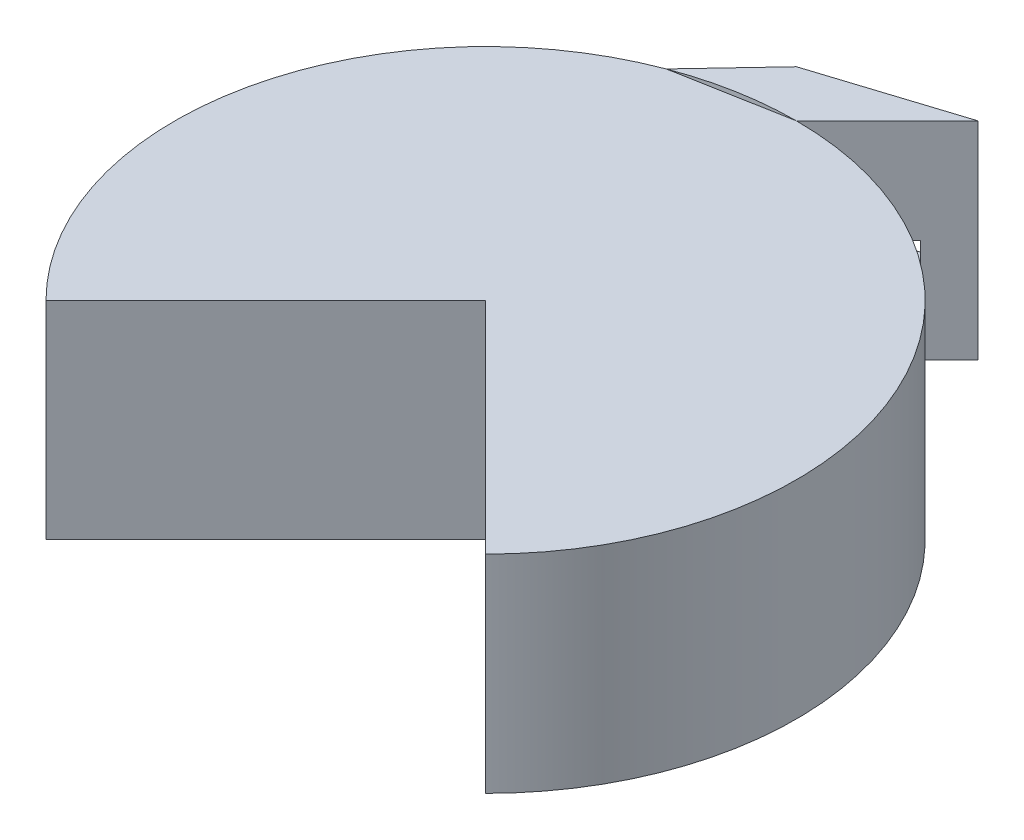
ISO-10303-21;
HEADER;
FILE_DESCRIPTION(('STEP AP214'),'2;1');
FILE_NAME('part.step','',(''),(''),'','','');
FILE_SCHEMA(('AUTOMOTIVE_DESIGN { 1 0 10303 214 1 1 1 1 }'));
ENDSEC;
DATA;
#1=APPLICATION_CONTEXT('core data for automotive mechanical design processes');
#2=APPLICATION_PROTOCOL_DEFINITION('international standard','automotive_design',2000,#1);
#3=PRODUCT_CONTEXT('',#1,'mechanical');
#4=PRODUCT('Part','Part','',(#3));
#5=PRODUCT_RELATED_PRODUCT_CATEGORY('part','',(#4));
#6=PRODUCT_DEFINITION_FORMATION('','',#4);
#7=PRODUCT_DEFINITION_CONTEXT('part definition',#1,'design');
#8=PRODUCT_DEFINITION('design','',#6,#7);
#9=PRODUCT_DEFINITION_SHAPE('','',#8);
#10=(LENGTH_UNIT() NAMED_UNIT(*) SI_UNIT(.MILLI.,.METRE.));
#11=(NAMED_UNIT(*) PLANE_ANGLE_UNIT() SI_UNIT($,.RADIAN.));
#12=(NAMED_UNIT(*) SI_UNIT($,.STERADIAN.) SOLID_ANGLE_UNIT());
#13=UNCERTAINTY_MEASURE_WITH_UNIT(LENGTH_MEASURE(1.E-05),#10,'distance_accuracy_value','');
#14=(GEOMETRIC_REPRESENTATION_CONTEXT(3) GLOBAL_UNCERTAINTY_ASSIGNED_CONTEXT((#13)) GLOBAL_UNIT_ASSIGNED_CONTEXT((#10,
#11,#12)) REPRESENTATION_CONTEXT('',''));
#15=CARTESIAN_POINT('',(0.,0.,0.));
#16=DIRECTION('',(0.,0.,1.));
#17=DIRECTION('',(1.,0.,0.));
#18=AXIS2_PLACEMENT_3D('',#15,#16,#17);
#19=CARTESIAN_POINT('',(-26.0271420220497,50.,-81.6219740955962));
#20=DIRECTION('',(0.303802613424122,0.,0.952734995723718));
#21=DIRECTION('',(0.952734995723718,0.,-0.303802613424122));
#22=AXIS2_PLACEMENT_3D('',#19,#20,#21);
#23=PLANE('',#22);
#24=DIRECTION('',(-0.952734995723718,0.,0.303802613424122));
#25=VECTOR('',#24,1.);
#26=CARTESIAN_POINT('',(-26.0271420220497,0.,-81.6219740955962));
#27=LINE('',#26,#25);
#28=CARTESIAN_POINT('',(21.9069052734475,0.,-96.9069052734475));
#29=VERTEX_POINT('',#28);
#30=CARTESIAN_POINT('',(-11.3137084989848,0.,-86.3137084989847));
#31=VERTEX_POINT('',#30);
#32=EDGE_CURVE('E199',#29,#31,#27,.T.);
#33=ORIENTED_EDGE('',*,*,#32,.T.);
#34=DIRECTION('',(0.,-1.,0.));
#35=VECTOR('',#34,1.);
#36=CARTESIAN_POINT('',(-11.3137084989848,50.,-86.3137084989847));
#37=LINE('',#36,#35);
#38=CARTESIAN_POINT('',(-11.3137084989848,50.,-86.3137084989847));
#39=VERTEX_POINT('',#38);
#40=EDGE_CURVE('E204',#39,#31,#37,.T.);
#41=ORIENTED_EDGE('',*,*,#40,.F.);
#42=DIRECTION('',(-0.952734995723718,0.,0.303802613424122));
#43=VECTOR('',#42,1.);
#44=CARTESIAN_POINT('',(-26.0271420220497,50.,-81.6219740955962));
#45=LINE('',#44,#43);
#46=CARTESIAN_POINT('',(21.9069052734475,50.,-96.9069052734475));
#47=VERTEX_POINT('',#46);
#48=EDGE_CURVE('E190',#47,#39,#45,.T.);
#49=ORIENTED_EDGE('',*,*,#48,.F.);
#50=DIRECTION('',(0.,-1.,0.));
#51=VECTOR('',#50,1.);
#52=CARTESIAN_POINT('',(21.9069052734475,50.,-96.9069052734475));
#53=LINE('',#52,#51);
#54=EDGE_CURVE('E206',#47,#29,#53,.T.);
#55=ORIENTED_EDGE('',*,*,#54,.T.);
#56=EDGE_LOOP('',(#33,#41,#49,#55));
#57=FACE_BOUND('',#56,.T.);
#58=DIRECTION('',(0.,-1.,0.));
#59=VECTOR('',#58,1.);
#60=CARTESIAN_POINT('',(-5.45294808413494,0.,-88.1825538113495));
#61=LINE('',#60,#59);
#62=CARTESIAN_POINT('',(-5.45294808413493,25.,-88.1825538113494));
#63=VERTEX_POINT('',#62);
#64=CARTESIAN_POINT('',(-5.45294808413494,19.,-88.1825538113495));
#65=VERTEX_POINT('',#64);
#66=EDGE_CURVE('E95',#63,#65,#61,.T.);
#67=ORIENTED_EDGE('',*,*,#66,.T.);
#68=DIRECTION('',(-0.952734995723718,0.,0.303802613424122));
#69=VECTOR('',#68,1.);
#70=CARTESIAN_POINT('',(-26.0271420220497,19.,-81.6219740955963));
#71=LINE('',#70,#69);
#72=CARTESIAN_POINT('',(13.6017518303394,19.,-94.2586060798319));
#73=VERTEX_POINT('',#72);
#74=EDGE_CURVE('E160',#73,#65,#71,.T.);
#75=ORIENTED_EDGE('',*,*,#74,.F.);
#76=DIRECTION('',(0.,-1.,0.));
#77=VECTOR('',#76,1.);
#78=CARTESIAN_POINT('',(13.6017518303395,0.,-94.2586060798319));
#79=LINE('',#78,#77);
#80=CARTESIAN_POINT('',(13.6017518303394,25.,-94.2586060798319));
#81=VERTEX_POINT('',#80);
#82=EDGE_CURVE('E146',#81,#73,#79,.T.);
#83=ORIENTED_EDGE('',*,*,#82,.F.);
#84=DIRECTION('',(-0.952734995723718,0.,0.303802613424122));
#85=VECTOR('',#84,1.);
#86=CARTESIAN_POINT('',(-26.0271420220497,25.,-81.6219740955963));
#87=LINE('',#86,#85);
#88=EDGE_CURVE('E155',#81,#63,#87,.T.);
#89=ORIENTED_EDGE('',*,*,#88,.T.);
#90=EDGE_LOOP('',(#67,#75,#83,#89));
#91=FACE_BOUND('',#90,.T.);
#92=ADVANCED_FACE('F72',(#57,#91),#23,.F.);
#93=CARTESIAN_POINT('',(0.,50.,0.));
#94=DIRECTION('',(0.,-1.,0.));
#95=DIRECTION('',(0.,0.,-1.));
#96=AXIS2_PLACEMENT_3D('',#93,#94,#95);
#97=CYLINDRICAL_SURFACE('',#96,75.);
#98=CARTESIAN_POINT('',(0.,19.,0.));
#99=DIRECTION('',(0.,-1.,0.));
#100=DIRECTION('',(0.,0.,-1.));
#101=AXIS2_PLACEMENT_3D('',#98,#99,#100);
#102=CIRCLE('',#101,75.);
#103=CARTESIAN_POINT('',(-1.24607074567603,19.,-74.9896480035529));
#104=VERTEX_POINT('',#103);
#105=CARTESIAN_POINT('',(0.,19.,-75.));
#106=VERTEX_POINT('',#105);
#107=EDGE_CURVE('E178',#104,#106,#102,.T.);
#108=ORIENTED_EDGE('',*,*,#107,.F.);
#109=DIRECTION('',(0.,-1.,0.));
#110=VECTOR('',#109,1.);
#111=CARTESIAN_POINT('',(-1.24607074567604,50.,-74.9896480035529));
#112=LINE('',#111,#110);
#113=CARTESIAN_POINT('',(-1.24607074567603,25.,-74.9896480035529));
#114=VERTEX_POINT('',#113);
#115=EDGE_CURVE('E180',#104,#114,#112,.F.);
#116=ORIENTED_EDGE('',*,*,#115,.T.);
#117=CARTESIAN_POINT('',(0.,25.,0.));
#118=DIRECTION('',(0.,-1.,0.));
#119=DIRECTION('',(0.,0.,-1.));
#120=AXIS2_PLACEMENT_3D('',#117,#118,#119);
#121=CIRCLE('',#120,75.);
#122=CARTESIAN_POINT('',(0.,25.,-75.));
#123=VERTEX_POINT('',#122);
#124=EDGE_CURVE('E171',#114,#123,#121,.T.);
#125=ORIENTED_EDGE('',*,*,#124,.T.);
#126=DIRECTION('',(0.,-1.,0.));
#127=VECTOR('',#126,1.);
#128=CARTESIAN_POINT('',(0.,50.,-75.));
#129=LINE('',#128,#127);
#130=CARTESIAN_POINT('',(0.,50.,-75.));
#131=VERTEX_POINT('',#130);
#132=EDGE_CURVE('E13',#131,#123,#129,.T.);
#133=ORIENTED_EDGE('',*,*,#132,.F.);
#134=CARTESIAN_POINT('',(0.,50.,0.));
#135=DIRECTION('',(0.,1.,0.));
#136=DIRECTION('',(0.,0.,1.));
#137=AXIS2_PLACEMENT_3D('',#134,#135,#136);
#138=CIRCLE('',#137,75.);
#139=CARTESIAN_POINT('',(-26.5554550147983,50.,-70.1413416535286));
#140=VERTEX_POINT('',#139);
#141=EDGE_CURVE('E184',#131,#140,#138,.T.);
#142=ORIENTED_EDGE('',*,*,#141,.T.);
#143=DIRECTION('',(0.,-1.,0.));
#144=VECTOR('',#143,1.);
#145=CARTESIAN_POINT('',(-26.5554550147983,50.,-70.1413416535286));
#146=LINE('',#145,#144);
#147=CARTESIAN_POINT('',(-26.5554550147983,0.,-70.1413416535286));
#148=VERTEX_POINT('',#147);
#149=EDGE_CURVE('E194',#140,#148,#146,.T.);
#150=ORIENTED_EDGE('',*,*,#149,.T.);
#151=CARTESIAN_POINT('',(0.,0.,0.));
#152=DIRECTION('',(0.,1.,0.));
#153=DIRECTION('',(0.,0.,1.));
#154=AXIS2_PLACEMENT_3D('',#151,#152,#153);
#155=CIRCLE('',#154,75.);
#156=CARTESIAN_POINT('',(0.,0.,-75.));
#157=VERTEX_POINT('',#156);
#158=EDGE_CURVE('E183',#157,#148,#155,.T.);
#159=ORIENTED_EDGE('',*,*,#158,.F.);
#160=EDGE_CURVE('E80',#106,#157,#129,.T.);
#161=ORIENTED_EDGE('',*,*,#160,.F.);
#162=EDGE_LOOP('',(#108,#116,#125,#133,#142,#150,#159,#161));
#163=FACE_BOUND('',#162,.T.);
#164=ADVANCED_FACE('F74',(#163),#97,.F.);
#165=CARTESIAN_POINT('',(-37.5,50.,-37.4999999999999));
#166=DIRECTION('',(-0.707106781186548,0.,-0.707106781186547));
#167=DIRECTION('',(-0.707106781186547,0.,0.707106781186548));
#168=AXIS2_PLACEMENT_3D('',#165,#166,#167);
#169=PLANE('',#168);
#170=DIRECTION('',(0.,-1.,0.));
#171=VECTOR('',#170,1.);
#172=CARTESIAN_POINT('',(14.9694523211513,50.0000000000002,-89.9694523211513));
#173=LINE('',#172,#171);
#174=CARTESIAN_POINT('',(14.9694523211514,25.,-89.9694523211514));
#175=VERTEX_POINT('',#174);
#176=CARTESIAN_POINT('',(14.9694523211514,19.,-89.9694523211514));
#177=VERTEX_POINT('',#176);
#178=EDGE_CURVE('E149',#175,#177,#173,.T.);
#179=ORIENTED_EDGE('',*,*,#178,.T.);
#180=DIRECTION('',(-0.707106781186547,0.,0.707106781186548));
#181=VECTOR('',#180,1.);
#182=CARTESIAN_POINT('',(-37.5,19.,-37.4999999999999));
#183=LINE('',#182,#181);
#184=EDGE_CURVE('E175',#177,#106,#183,.T.);
#185=ORIENTED_EDGE('',*,*,#184,.T.);
#186=ORIENTED_EDGE('',*,*,#160,.T.);
#187=DIRECTION('',(0.707106781186547,0.,-0.707106781186548));
#188=VECTOR('',#187,1.);
#189=CARTESIAN_POINT('',(-37.5,0.,-37.4999999999999));
#190=LINE('',#189,#188);
#191=EDGE_CURVE('E197',#157,#29,#190,.T.);
#192=ORIENTED_EDGE('',*,*,#191,.T.);
#193=ORIENTED_EDGE('',*,*,#54,.F.);
#194=DIRECTION('',(0.707106781186547,0.,-0.707106781186548));
#195=VECTOR('',#194,1.);
#196=CARTESIAN_POINT('',(-37.5,50.,-37.4999999999999));
#197=LINE('',#196,#195);
#198=EDGE_CURVE('E187',#131,#47,#197,.T.);
#199=ORIENTED_EDGE('',*,*,#198,.F.);
#200=ORIENTED_EDGE('',*,*,#132,.T.);
#201=DIRECTION('',(-0.707106781186547,0.,0.707106781186548));
#202=VECTOR('',#201,1.);
#203=CARTESIAN_POINT('',(-37.5,25.,-37.4999999999999));
#204=LINE('',#203,#202);
#205=EDGE_CURVE('E167',#175,#123,#204,.T.);
#206=ORIENTED_EDGE('',*,*,#205,.F.);
#207=EDGE_LOOP('',(#179,#185,#186,#192,#193,#199,#200,#206));
#208=FACE_BOUND('',#207,.T.);
#209=ADVANCED_FACE('F215',(#208),#169,.F.);
#210=CARTESIAN_POINT('',(-49.0728927412566,50.,-46.2490493263877));
#211=DIRECTION('',(0.727735047590559,0.,0.685858367673944));
#212=DIRECTION('',(0.685858367673944,0.,-0.727735047590559));
#213=AXIS2_PLACEMENT_3D('',#210,#211,#212);
#214=PLANE('',#213);
#215=DIRECTION('',(-0.685858367673944,0.,0.727735047590559));
#216=VECTOR('',#215,1.);
#217=CARTESIAN_POINT('',(-49.0728927412566,0.,-46.2490493263877));
#218=LINE('',#217,#216);
#219=EDGE_CURVE('E188',#31,#148,#218,.T.);
#220=ORIENTED_EDGE('',*,*,#219,.T.);
#221=ORIENTED_EDGE('',*,*,#149,.F.);
#222=DIRECTION('',(-0.685858367673944,0.,0.727735047590559));
#223=VECTOR('',#222,1.);
#224=CARTESIAN_POINT('',(-49.0728927412566,50.,-46.2490493263877));
#225=LINE('',#224,#223);
#226=EDGE_CURVE('E192',#39,#140,#225,.T.);
#227=ORIENTED_EDGE('',*,*,#226,.F.);
#228=ORIENTED_EDGE('',*,*,#40,.T.);
#229=EDGE_LOOP('',(#220,#221,#227,#228));
#230=FACE_BOUND('',#229,.T.);
#231=ADVANCED_FACE('F226',(#230),#214,.F.);
#232=CARTESIAN_POINT('',(0.,50.,0.));
#233=DIRECTION('',(0.,1.,0.));
#234=DIRECTION('',(0.,0.,1.));
#235=AXIS2_PLACEMENT_3D('',#232,#233,#234);
#236=PLANE('',#235);
#237=ORIENTED_EDGE('',*,*,#141,.F.);
#238=ORIENTED_EDGE('',*,*,#198,.T.);
#239=ORIENTED_EDGE('',*,*,#48,.T.);
#240=ORIENTED_EDGE('',*,*,#226,.T.);
#241=EDGE_LOOP('',(#237,#238,#239,#240));
#242=FACE_BOUND('',#241,.T.);
#243=ADVANCED_FACE('F229',(#242),#236,.T.);
#244=CARTESIAN_POINT('',(0.,0.,0.));
#245=DIRECTION('',(0.,1.,0.));
#246=DIRECTION('',(0.,0.,1.));
#247=AXIS2_PLACEMENT_3D('',#244,#245,#246);
#248=PLANE('',#247);
#249=ORIENTED_EDGE('',*,*,#158,.T.);
#250=ORIENTED_EDGE('',*,*,#219,.F.);
#251=ORIENTED_EDGE('',*,*,#32,.F.);
#252=ORIENTED_EDGE('',*,*,#191,.F.);
#253=EDGE_LOOP('',(#249,#250,#251,#252));
#254=FACE_BOUND('',#253,.T.);
#255=ADVANCED_FACE('F220',(#254),#248,.F.);
#256=CARTESIAN_POINT('',(18.4625936451254,0.,-79.0148461482524));
#257=DIRECTION('',(0.952734995723718,0.,-0.303802613424122));
#258=DIRECTION('',(-0.303802613424122,0.,-0.952734995723718));
#259=AXIS2_PLACEMENT_3D('',#256,#257,#258);
#260=PLANE('',#259);
#261=DIRECTION('',(-0.303802613424122,0.,-0.952734995723718));
#262=VECTOR('',#261,1.);
#263=CARTESIAN_POINT('',(18.4625936451254,25.,-79.0148461482524));
#264=LINE('',#263,#262);
#265=EDGE_CURVE('E87',#175,#81,#264,.T.);
#266=ORIENTED_EDGE('',*,*,#265,.T.);
#267=ORIENTED_EDGE('',*,*,#82,.T.);
#268=DIRECTION('',(-0.303802613424122,0.,-0.952734995723718));
#269=VECTOR('',#268,1.);
#270=CARTESIAN_POINT('',(18.4625936451254,19.,-79.0148461482524));
#271=LINE('',#270,#269);
#272=EDGE_CURVE('E151',#177,#73,#271,.T.);
#273=ORIENTED_EDGE('',*,*,#272,.F.);
#274=ORIENTED_EDGE('',*,*,#178,.F.);
#275=EDGE_LOOP('',(#266,#267,#273,#274));
#276=FACE_BOUND('',#275,.T.);
#277=ADVANCED_FACE('F143',(#276),#260,.F.);
#278=CARTESIAN_POINT('',(-0.592106269348992,0.,-72.93879387977));
#279=DIRECTION('',(0.952734995723718,0.,-0.303802613424122));
#280=DIRECTION('',(-0.303802613424122,0.,-0.952734995723718));
#281=AXIS2_PLACEMENT_3D('',#278,#279,#280);
#282=PLANE('',#281);
#283=DIRECTION('',(-0.303802613424122,0.,-0.952734995723718));
#284=VECTOR('',#283,1.);
#285=CARTESIAN_POINT('',(-0.59210626934899,19.,-72.93879387977));
#286=LINE('',#285,#284);
#287=EDGE_CURVE('E165',#104,#65,#286,.T.);
#288=ORIENTED_EDGE('',*,*,#287,.T.);
#289=ORIENTED_EDGE('',*,*,#66,.F.);
#290=DIRECTION('',(-0.303802613424122,0.,-0.952734995723718));
#291=VECTOR('',#290,1.);
#292=CARTESIAN_POINT('',(-0.592106269348985,25.,-72.93879387977));
#293=LINE('',#292,#291);
#294=EDGE_CURVE('E152',#114,#63,#293,.T.);
#295=ORIENTED_EDGE('',*,*,#294,.F.);
#296=ORIENTED_EDGE('',*,*,#115,.F.);
#297=EDGE_LOOP('',(#288,#289,#295,#296));
#298=FACE_BOUND('',#297,.T.);
#299=ADVANCED_FACE('F231',(#298),#282,.T.);
#300=CARTESIAN_POINT('',(-21.1663002072637,19.,-66.3782141640168));
#301=DIRECTION('',(0.,-1.,0.));
#302=DIRECTION('',(0.,0.,-1.));
#303=AXIS2_PLACEMENT_3D('',#300,#301,#302);
#304=PLANE('',#303);
#305=ORIENTED_EDGE('',*,*,#107,.T.);
#306=ORIENTED_EDGE('',*,*,#184,.F.);
#307=ORIENTED_EDGE('',*,*,#272,.T.);
#308=ORIENTED_EDGE('',*,*,#74,.T.);
#309=ORIENTED_EDGE('',*,*,#287,.F.);
#310=EDGE_LOOP('',(#305,#306,#307,#308,#309));
#311=FACE_BOUND('',#310,.T.);
#312=ADVANCED_FACE('F234',(#311),#304,.F.);
#313=CARTESIAN_POINT('',(-21.1663002072637,25.,-66.3782141640168));
#314=DIRECTION('',(0.,-1.,0.));
#315=DIRECTION('',(0.,0.,-1.));
#316=AXIS2_PLACEMENT_3D('',#313,#314,#315);
#317=PLANE('',#316);
#318=ORIENTED_EDGE('',*,*,#294,.T.);
#319=ORIENTED_EDGE('',*,*,#88,.F.);
#320=ORIENTED_EDGE('',*,*,#265,.F.);
#321=ORIENTED_EDGE('',*,*,#205,.T.);
#322=ORIENTED_EDGE('',*,*,#124,.F.);
#323=EDGE_LOOP('',(#318,#319,#320,#321,#322));
#324=FACE_BOUND('',#323,.T.);
#325=ADVANCED_FACE('F156',(#324),#317,.T.);
#326=CLOSED_SHELL('',(#92,#164,#209,#231,#243,#255,#277,#299,#312,#325));
#327=MANIFOLD_SOLID_BREP('B2',#326);
#328=CARTESIAN_POINT('',(0.,50.,0.));
#329=DIRECTION('',(-0.707106781186548,0.,0.707106781186548));
#330=DIRECTION('',(0.707106781186548,0.,0.707106781186548));
#331=AXIS2_PLACEMENT_3D('',#328,#329,#330);
#332=PLANE('',#331);
#333=DIRECTION('',(-0.707106781186548,0.,-0.707106781186548));
#334=VECTOR('',#333,1.);
#335=CARTESIAN_POINT('',(0.,0.,0.));
#336=LINE('',#335,#334);
#337=CARTESIAN_POINT('',(53.0330085889911,0.,53.0330085889911));
#338=VERTEX_POINT('',#337);
#339=CARTESIAN_POINT('',(0.,0.,0.));
#340=VERTEX_POINT('',#339);
#341=EDGE_CURVE('E420',#338,#340,#336,.T.);
#342=ORIENTED_EDGE('',*,*,#341,.F.);
#343=DIRECTION('',(0.,-1.,0.));
#344=VECTOR('',#343,1.);
#345=CARTESIAN_POINT('',(53.0330085889911,50.,53.0330085889911));
#346=LINE('',#345,#344);
#347=CARTESIAN_POINT('',(53.0330085889911,50.,53.0330085889911));
#348=VERTEX_POINT('',#347);
#349=EDGE_CURVE('E378',#348,#338,#346,.T.);
#350=ORIENTED_EDGE('',*,*,#349,.F.);
#351=DIRECTION('',(-0.707106781186548,0.,-0.707106781186548));
#352=VECTOR('',#351,1.);
#353=CARTESIAN_POINT('',(0.,50.,0.));
#354=LINE('',#353,#352);
#355=CARTESIAN_POINT('',(0.,50.,0.));
#356=VERTEX_POINT('',#355);
#357=EDGE_CURVE('E415',#348,#356,#354,.T.);
#358=ORIENTED_EDGE('',*,*,#357,.T.);
#359=DIRECTION('',(0.,-1.,0.));
#360=VECTOR('',#359,1.);
#361=CARTESIAN_POINT('',(0.,50.,0.));
#362=LINE('',#361,#360);
#363=EDGE_CURVE('E351',#356,#340,#362,.T.);
#364=ORIENTED_EDGE('',*,*,#363,.T.);
#365=EDGE_LOOP('',(#342,#350,#358,#364));
#366=FACE_BOUND('',#365,.T.);
#367=ADVANCED_FACE('F328',(#366),#332,.T.);
#368=CARTESIAN_POINT('',(0.,50.,0.));
#369=DIRECTION('',(0.,-1.,0.));
#370=DIRECTION('',(0.,0.,-1.));
#371=AXIS2_PLACEMENT_3D('',#368,#369,#370);
#372=CYLINDRICAL_SURFACE('',#371,75.);
#373=DIRECTION('',(0.,-1.,0.));
#374=VECTOR('',#373,1.);
#375=CARTESIAN_POINT('',(0.,50.,-75.));
#376=LINE('',#375,#374);
#377=CARTESIAN_POINT('',(0.,19.,-75.));
#378=VERTEX_POINT('',#377);
#379=CARTESIAN_POINT('',(0.,0.,-75.));
#380=VERTEX_POINT('',#379);
#381=EDGE_CURVE('E400',#378,#380,#376,.T.);
#382=ORIENTED_EDGE('',*,*,#381,.F.);
#383=CARTESIAN_POINT('',(0.,19.,0.));
#384=DIRECTION('',(0.,-1.,0.));
#385=DIRECTION('',(0.,0.,-1.));
#386=AXIS2_PLACEMENT_3D('',#383,#384,#385);
#387=CIRCLE('',#386,75.);
#388=CARTESIAN_POINT('',(5.28681921799899,19.,-74.8134315651688));
#389=VERTEX_POINT('',#388);
#390=EDGE_CURVE('E423',#378,#389,#387,.T.);
#391=ORIENTED_EDGE('',*,*,#390,.T.);
#392=DIRECTION('',(0.,-1.,0.));
#393=VECTOR('',#392,1.);
#394=CARTESIAN_POINT('',(5.28681921799899,50.,-74.8134315651688));
#395=LINE('',#394,#393);
#396=CARTESIAN_POINT('',(5.28681921799899,25.,-74.8134315651688));
#397=VERTEX_POINT('',#396);
#398=EDGE_CURVE('E70',#397,#389,#395,.T.);
#399=ORIENTED_EDGE('',*,*,#398,.F.);
#400=CARTESIAN_POINT('',(0.,25.,0.));
#401=DIRECTION('',(0.,-1.,0.));
#402=DIRECTION('',(0.,0.,-1.));
#403=AXIS2_PLACEMENT_3D('',#400,#401,#402);
#404=CIRCLE('',#403,75.);
#405=CARTESIAN_POINT('',(0.,25.,-75.));
#406=VERTEX_POINT('',#405);
#407=EDGE_CURVE('E460',#406,#397,#404,.T.);
#408=ORIENTED_EDGE('',*,*,#407,.F.);
#409=CARTESIAN_POINT('',(0.,50.,-75.));
#410=VERTEX_POINT('',#409);
#411=EDGE_CURVE('E434',#410,#406,#376,.T.);
#412=ORIENTED_EDGE('',*,*,#411,.F.);
#413=CARTESIAN_POINT('',(0.,50.,0.));
#414=DIRECTION('',(0.,1.,0.));
#415=DIRECTION('',(0.,0.,1.));
#416=AXIS2_PLACEMENT_3D('',#413,#414,#415);
#417=CIRCLE('',#416,75.);
#418=EDGE_CURVE('E412',#348,#410,#417,.T.);
#419=ORIENTED_EDGE('',*,*,#418,.F.);
#420=ORIENTED_EDGE('',*,*,#349,.T.);
#421=CARTESIAN_POINT('',(0.,0.,0.));
#422=DIRECTION('',(0.,1.,0.));
#423=DIRECTION('',(0.,0.,1.));
#424=AXIS2_PLACEMENT_3D('',#421,#422,#423);
#425=CIRCLE('',#424,75.);
#426=EDGE_CURVE('E422',#338,#380,#425,.T.);
#427=ORIENTED_EDGE('',*,*,#426,.T.);
#428=EDGE_LOOP('',(#382,#391,#399,#408,#412,#419,#420,#427));
#429=FACE_BOUND('',#428,.T.);
#430=ADVANCED_FACE('F471',(#429),#372,.T.);
#431=CARTESIAN_POINT('',(-13.2777275073992,50.,-72.5706708267643));
#432=DIRECTION('',(-0.179975152849339,0.,-0.983671156615287));
#433=DIRECTION('',(-0.983671156615287,0.,0.179975152849339));
#434=AXIS2_PLACEMENT_3D('',#431,#432,#433);
#435=PLANE('',#434);
#436=DIRECTION('',(-0.983671156615287,0.,0.179975152849339));
#437=VECTOR('',#436,1.);
#438=CARTESIAN_POINT('',(-13.2777275073992,19.,-72.5706708267643));
#439=LINE('',#438,#437);
#440=CARTESIAN_POINT('',(-1.18049895128723,19.,-74.7840126979758));
#441=VERTEX_POINT('',#440);
#442=EDGE_CURVE('E335',#378,#441,#439,.T.);
#443=ORIENTED_EDGE('',*,*,#442,.F.);
#444=ORIENTED_EDGE('',*,*,#381,.T.);
#445=DIRECTION('',(0.983671156615287,0.,-0.179975152849339));
#446=VECTOR('',#445,1.);
#447=CARTESIAN_POINT('',(-13.2777275073992,0.,-72.5706708267643));
#448=LINE('',#447,#446);
#449=CARTESIAN_POINT('',(-26.5554550147983,0.,-70.1413416535286));
#450=VERTEX_POINT('',#449);
#451=EDGE_CURVE('E396',#450,#380,#448,.T.);
#452=ORIENTED_EDGE('',*,*,#451,.F.);
#453=DIRECTION('',(0.,-1.,0.));
#454=VECTOR('',#453,1.);
#455=CARTESIAN_POINT('',(-26.5554550147983,50.,-70.1413416535286));
#456=LINE('',#455,#454);
#457=CARTESIAN_POINT('',(-26.5554550147983,50.,-70.1413416535286));
#458=VERTEX_POINT('',#457);
#459=EDGE_CURVE('E388',#458,#450,#456,.T.);
#460=ORIENTED_EDGE('',*,*,#459,.F.);
#461=DIRECTION('',(0.983671156615287,0.,-0.179975152849339));
#462=VECTOR('',#461,1.);
#463=CARTESIAN_POINT('',(-13.2777275073992,50.,-72.5706708267643));
#464=LINE('',#463,#462);
#465=EDGE_CURVE('E394',#458,#410,#464,.T.);
#466=ORIENTED_EDGE('',*,*,#465,.T.);
#467=ORIENTED_EDGE('',*,*,#411,.T.);
#468=DIRECTION('',(-0.983671156615287,0.,0.179975152849339));
#469=VECTOR('',#468,1.);
#470=CARTESIAN_POINT('',(-13.2777275073992,25.,-72.5706708267643));
#471=LINE('',#470,#469);
#472=CARTESIAN_POINT('',(-1.18049895128722,25.,-74.7840126979758));
#473=VERTEX_POINT('',#472);
#474=EDGE_CURVE('E437',#406,#473,#471,.T.);
#475=ORIENTED_EDGE('',*,*,#474,.T.);
#476=DIRECTION('',(0.,-1.,0.));
#477=VECTOR('',#476,1.);
#478=CARTESIAN_POINT('',(-1.18049895128723,50.,-74.7840126979758));
#479=LINE('',#478,#477);
#480=EDGE_CURVE('E440',#473,#441,#479,.T.);
#481=ORIENTED_EDGE('',*,*,#480,.T.);
#482=EDGE_LOOP('',(#443,#444,#452,#460,#466,#467,#475,#481));
#483=FACE_BOUND('',#482,.T.);
#484=ADVANCED_FACE('F391',(#483),#435,.T.);
#485=CARTESIAN_POINT('',(0.,50.,0.));
#486=DIRECTION('',(0.,-1.,0.));
#487=DIRECTION('',(0.,0.,-1.));
#488=AXIS2_PLACEMENT_3D('',#485,#486,#487);
#489=CYLINDRICAL_SURFACE('',#488,75.);
#490=CARTESIAN_POINT('',(0.,0.,0.));
#491=DIRECTION('',(0.,1.,0.));
#492=DIRECTION('',(0.,0.,1.));
#493=AXIS2_PLACEMENT_3D('',#490,#491,#492);
#494=CIRCLE('',#493,75.);
#495=CARTESIAN_POINT('',(-53.0330085889911,0.,53.0330085889911));
#496=VERTEX_POINT('',#495);
#497=EDGE_CURVE('E427',#450,#496,#494,.T.);
#498=ORIENTED_EDGE('',*,*,#497,.T.);
#499=DIRECTION('',(0.,-1.,0.));
#500=VECTOR('',#499,1.);
#501=CARTESIAN_POINT('',(-53.0330085889911,50.,53.0330085889911));
#502=LINE('',#501,#500);
#503=CARTESIAN_POINT('',(-53.0330085889911,50.,53.0330085889911));
#504=VERTEX_POINT('',#503);
#505=EDGE_CURVE('E401',#504,#496,#502,.T.);
#506=ORIENTED_EDGE('',*,*,#505,.F.);
#507=CARTESIAN_POINT('',(0.,50.,0.));
#508=DIRECTION('',(0.,1.,0.));
#509=DIRECTION('',(0.,0.,1.));
#510=AXIS2_PLACEMENT_3D('',#507,#508,#509);
#511=CIRCLE('',#510,75.);
#512=EDGE_CURVE('E404',#458,#504,#511,.T.);
#513=ORIENTED_EDGE('',*,*,#512,.F.);
#514=ORIENTED_EDGE('',*,*,#459,.T.);
#515=EDGE_LOOP('',(#498,#506,#513,#514));
#516=FACE_BOUND('',#515,.T.);
#517=ADVANCED_FACE('F405',(#516),#489,.T.);
#518=CARTESIAN_POINT('',(0.,50.,0.));
#519=DIRECTION('',(0.707106781186548,0.,0.707106781186548));
#520=DIRECTION('',(0.707106781186548,0.,-0.707106781186548));
#521=AXIS2_PLACEMENT_3D('',#518,#519,#520);
#522=PLANE('',#521);
#523=DIRECTION('',(-0.707106781186548,0.,0.707106781186548));
#524=VECTOR('',#523,1.);
#525=CARTESIAN_POINT('',(0.,0.,0.));
#526=LINE('',#525,#524);
#527=EDGE_CURVE('E429',#340,#496,#526,.T.);
#528=ORIENTED_EDGE('',*,*,#527,.F.);
#529=ORIENTED_EDGE('',*,*,#363,.F.);
#530=DIRECTION('',(-0.707106781186548,0.,0.707106781186548));
#531=VECTOR('',#530,1.);
#532=CARTESIAN_POINT('',(0.,50.,0.));
#533=LINE('',#532,#531);
#534=EDGE_CURVE('E408',#356,#504,#533,.T.);
#535=ORIENTED_EDGE('',*,*,#534,.T.);
#536=ORIENTED_EDGE('',*,*,#505,.T.);
#537=EDGE_LOOP('',(#528,#529,#535,#536));
#538=FACE_BOUND('',#537,.T.);
#539=ADVANCED_FACE('F475',(#538),#522,.T.);
#540=CARTESIAN_POINT('',(0.,50.,0.));
#541=DIRECTION('',(0.,1.,0.));
#542=DIRECTION('',(0.,0.,1.));
#543=AXIS2_PLACEMENT_3D('',#540,#541,#542);
#544=PLANE('',#543);
#545=ORIENTED_EDGE('',*,*,#357,.F.);
#546=ORIENTED_EDGE('',*,*,#418,.T.);
#547=ORIENTED_EDGE('',*,*,#465,.F.);
#548=ORIENTED_EDGE('',*,*,#512,.T.);
#549=ORIENTED_EDGE('',*,*,#534,.F.);
#550=EDGE_LOOP('',(#545,#546,#547,#548,#549));
#551=FACE_BOUND('',#550,.T.);
#552=ADVANCED_FACE('F411',(#551),#544,.T.);
#553=CARTESIAN_POINT('',(0.,0.,0.));
#554=DIRECTION('',(0.,1.,0.));
#555=DIRECTION('',(0.,0.,1.));
#556=AXIS2_PLACEMENT_3D('',#553,#554,#555);
#557=PLANE('',#556);
#558=CARTESIAN_POINT('',(38.6370330515627,0.,-44.2820323027551));
#559=DIRECTION('',(0.,-1.,0.));
#560=DIRECTION('',(0.,0.,-1.));
#561=AXIS2_PLACEMENT_3D('',#558,#559,#560);
#562=CIRCLE('',#561,15.);
#563=CARTESIAN_POINT('',(38.6370330515627,0.,-59.2820323027551));
#564=VERTEX_POINT('',#563);
#565=EDGE_CURVE('E512',#564,#564,#562,.T.);
#566=ORIENTED_EDGE('',*,*,#565,.F.);
#567=EDGE_LOOP('',(#566));
#568=FACE_BOUND('',#567,.T.);
#569=CARTESIAN_POINT('',(-38.6370330515627,0.,-44.2820323027551));
#570=DIRECTION('',(0.,-1.,0.));
#571=DIRECTION('',(0.,0.,-1.));
#572=AXIS2_PLACEMENT_3D('',#569,#570,#571);
#573=CIRCLE('',#572,15.);
#574=CARTESIAN_POINT('',(-38.6370330515627,0.,-59.2820323027551));
#575=VERTEX_POINT('',#574);
#576=EDGE_CURVE('E506',#575,#575,#573,.T.);
#577=ORIENTED_EDGE('',*,*,#576,.F.);
#578=EDGE_LOOP('',(#577));
#579=FACE_BOUND('',#578,.T.);
#580=CARTESIAN_POINT('',(38.6370330515627,0.,10.3527618041008));
#581=DIRECTION('',(0.,-1.,0.));
#582=DIRECTION('',(0.,0.,-1.));
#583=AXIS2_PLACEMENT_3D('',#580,#581,#582);
#584=CIRCLE('',#583,18.);
#585=CARTESIAN_POINT('',(38.6370330515627,0.,-7.64723819589917));
#586=VERTEX_POINT('',#585);
#587=EDGE_CURVE('E500',#586,#586,#584,.T.);
#588=ORIENTED_EDGE('',*,*,#587,.F.);
#589=EDGE_LOOP('',(#588));
#590=FACE_BOUND('',#589,.T.);
#591=CARTESIAN_POINT('',(-38.6370330515627,0.,10.3527618041008));
#592=DIRECTION('',(0.,-1.,0.));
#593=DIRECTION('',(0.,0.,-1.));
#594=AXIS2_PLACEMENT_3D('',#591,#592,#593);
#595=CIRCLE('',#594,18.);
#596=CARTESIAN_POINT('',(-38.6370330515627,0.,-7.64723819589917));
#597=VERTEX_POINT('',#596);
#598=EDGE_CURVE('E493',#597,#597,#595,.T.);
#599=ORIENTED_EDGE('',*,*,#598,.F.);
#600=EDGE_LOOP('',(#599));
#601=FACE_BOUND('',#600,.T.);
#602=ORIENTED_EDGE('',*,*,#341,.T.);
#603=ORIENTED_EDGE('',*,*,#527,.T.);
#604=ORIENTED_EDGE('',*,*,#497,.F.);
#605=ORIENTED_EDGE('',*,*,#451,.T.);
#606=ORIENTED_EDGE('',*,*,#426,.F.);
#607=EDGE_LOOP('',(#602,#603,#604,#605,#606));
#608=FACE_BOUND('',#607,.T.);
#609=ADVANCED_FACE('F477',(#568,#579,#590,#601,#608),#557,.F.);
#610=CARTESIAN_POINT('',(-21.1663002072637,0.,-66.3782141640168));
#611=DIRECTION('',(-0.303802613424122,0.,-0.952734995723718));
#612=DIRECTION('',(-0.952734995723718,0.,0.303802613424122));
#613=AXIS2_PLACEMENT_3D('',#610,#611,#612);
#614=PLANE('',#613);
#615=ORIENTED_EDGE('',*,*,#398,.T.);
#616=DIRECTION('',(-0.952734995723718,0.,0.303802613424122));
#617=VECTOR('',#616,1.);
#618=CARTESIAN_POINT('',(-21.1663002072637,19.,-66.3782141640168));
#619=LINE('',#618,#617);
#620=CARTESIAN_POINT('',(-0.59210626934899,19.,-72.93879387977));
#621=VERTEX_POINT('',#620);
#622=EDGE_CURVE('E487',#389,#621,#619,.T.);
#623=ORIENTED_EDGE('',*,*,#622,.T.);
#624=DIRECTION('',(0.,-1.,0.));
#625=VECTOR('',#624,1.);
#626=CARTESIAN_POINT('',(-0.592106269348992,0.,-72.93879387977));
#627=LINE('',#626,#625);
#628=CARTESIAN_POINT('',(-0.592106269348985,25.,-72.93879387977));
#629=VERTEX_POINT('',#628);
#630=EDGE_CURVE('E459',#629,#621,#627,.T.);
#631=ORIENTED_EDGE('',*,*,#630,.F.);
#632=DIRECTION('',(-0.952734995723718,0.,0.303802613424122));
#633=VECTOR('',#632,1.);
#634=CARTESIAN_POINT('',(-21.1663002072637,25.,-66.3782141640168));
#635=LINE('',#634,#633);
#636=EDGE_CURVE('E486',#397,#629,#635,.T.);
#637=ORIENTED_EDGE('',*,*,#636,.F.);
#638=EDGE_LOOP('',(#615,#623,#631,#637));
#639=FACE_BOUND('',#638,.T.);
#640=ADVANCED_FACE('F489',(#639),#614,.T.);
#641=CARTESIAN_POINT('',(-21.1663002072637,19.,-66.3782141640168));
#642=DIRECTION('',(0.,-1.,0.));
#643=DIRECTION('',(0.,0.,-1.));
#644=AXIS2_PLACEMENT_3D('',#641,#642,#643);
#645=PLANE('',#644);
#646=ORIENTED_EDGE('',*,*,#442,.T.);
#647=DIRECTION('',(-0.303802613424122,0.,-0.952734995723718));
#648=VECTOR('',#647,1.);
#649=CARTESIAN_POINT('',(-0.59210626934899,19.,-72.93879387977));
#650=LINE('',#649,#648);
#651=EDGE_CURVE('E451',#621,#441,#650,.T.);
#652=ORIENTED_EDGE('',*,*,#651,.F.);
#653=ORIENTED_EDGE('',*,*,#622,.F.);
#654=ORIENTED_EDGE('',*,*,#390,.F.);
#655=EDGE_LOOP('',(#646,#652,#653,#654));
#656=FACE_BOUND('',#655,.T.);
#657=ADVANCED_FACE('F448',(#656),#645,.F.);
#658=CARTESIAN_POINT('',(-21.1663002072637,25.,-66.3782141640168));
#659=DIRECTION('',(0.,-1.,0.));
#660=DIRECTION('',(0.,0.,-1.));
#661=AXIS2_PLACEMENT_3D('',#658,#659,#660);
#662=PLANE('',#661);
#663=ORIENTED_EDGE('',*,*,#407,.T.);
#664=ORIENTED_EDGE('',*,*,#636,.T.);
#665=DIRECTION('',(-0.303802613424122,0.,-0.952734995723718));
#666=VECTOR('',#665,1.);
#667=CARTESIAN_POINT('',(-0.592106269348985,25.,-72.93879387977));
#668=LINE('',#667,#666);
#669=EDGE_CURVE('E342',#629,#473,#668,.T.);
#670=ORIENTED_EDGE('',*,*,#669,.T.);
#671=ORIENTED_EDGE('',*,*,#474,.F.);
#672=EDGE_LOOP('',(#663,#664,#670,#671));
#673=FACE_BOUND('',#672,.T.);
#674=ADVANCED_FACE('F465',(#673),#662,.T.);
#675=CARTESIAN_POINT('',(-0.592106269348992,0.,-72.93879387977));
#676=DIRECTION('',(0.952734995723718,0.,-0.303802613424122));
#677=DIRECTION('',(-0.303802613424122,0.,-0.952734995723718));
#678=AXIS2_PLACEMENT_3D('',#675,#676,#677);
#679=PLANE('',#678);
#680=ORIENTED_EDGE('',*,*,#669,.F.);
#681=ORIENTED_EDGE('',*,*,#630,.T.);
#682=ORIENTED_EDGE('',*,*,#651,.T.);
#683=ORIENTED_EDGE('',*,*,#480,.F.);
#684=EDGE_LOOP('',(#680,#681,#682,#683));
#685=FACE_BOUND('',#684,.T.);
#686=ADVANCED_FACE('F457',(#685),#679,.T.);
#687=CARTESIAN_POINT('',(-38.6370330515627,30.,10.3527618041008));
#688=DIRECTION('',(0.,-1.,0.));
#689=DIRECTION('',(0.,0.,-1.));
#690=AXIS2_PLACEMENT_3D('',#687,#688,#689);
#691=CYLINDRICAL_SURFACE('',#690,18.);
#692=CARTESIAN_POINT('',(-38.6370330515627,30.,10.3527618041008));
#693=DIRECTION('',(0.,-1.,0.));
#694=DIRECTION('',(0.,0.,-1.));
#695=AXIS2_PLACEMENT_3D('',#692,#693,#694);
#696=CIRCLE('',#695,18.);
#697=CARTESIAN_POINT('',(-38.6370330515627,30.,-7.64723819589917));
#698=VERTEX_POINT('',#697);
#699=EDGE_CURVE('E490',#698,#698,#696,.T.);
#700=ORIENTED_EDGE('',*,*,#699,.F.);
#701=EDGE_LOOP('',(#700));
#702=FACE_BOUND('',#701,.T.);
#703=ORIENTED_EDGE('',*,*,#598,.T.);
#704=EDGE_LOOP('',(#703));
#705=FACE_BOUND('',#704,.T.);
#706=ADVANCED_FACE('F536',(#702,#705),#691,.F.);
#707=CARTESIAN_POINT('',(-38.6370330515627,30.,10.3527618041008));
#708=DIRECTION('',(0.,-1.,0.));
#709=DIRECTION('',(0.,0.,-1.));
#710=AXIS2_PLACEMENT_3D('',#707,#708,#709);
#711=PLANE('',#710);
#712=ORIENTED_EDGE('',*,*,#699,.T.);
#713=EDGE_LOOP('',(#712));
#714=FACE_BOUND('',#713,.T.);
#715=ADVANCED_FACE('F538',(#714),#711,.T.);
#716=CARTESIAN_POINT('',(38.6370330515627,30.,10.3527618041008));
#717=DIRECTION('',(0.,-1.,0.));
#718=DIRECTION('',(0.,0.,-1.));
#719=AXIS2_PLACEMENT_3D('',#716,#717,#718);
#720=CYLINDRICAL_SURFACE('',#719,18.);
#721=CARTESIAN_POINT('',(38.6370330515627,30.,10.3527618041008));
#722=DIRECTION('',(0.,-1.,0.));
#723=DIRECTION('',(0.,0.,-1.));
#724=AXIS2_PLACEMENT_3D('',#721,#722,#723);
#725=CIRCLE('',#724,18.);
#726=CARTESIAN_POINT('',(38.6370330515627,30.,-7.64723819589917));
#727=VERTEX_POINT('',#726);
#728=EDGE_CURVE('E498',#727,#727,#725,.T.);
#729=ORIENTED_EDGE('',*,*,#728,.F.);
#730=EDGE_LOOP('',(#729));
#731=FACE_BOUND('',#730,.T.);
#732=ORIENTED_EDGE('',*,*,#587,.T.);
#733=EDGE_LOOP('',(#732));
#734=FACE_BOUND('',#733,.T.);
#735=ADVANCED_FACE('F545',(#731,#734),#720,.F.);
#736=CARTESIAN_POINT('',(0.,30.,0.));
#737=DIRECTION('',(0.,-1.,0.));
#738=DIRECTION('',(0.,0.,-1.));
#739=AXIS2_PLACEMENT_3D('',#736,#737,#738);
#740=PLANE('',#739);
#741=ORIENTED_EDGE('',*,*,#728,.T.);
#742=EDGE_LOOP('',(#741));
#743=FACE_BOUND('',#742,.T.);
#744=ADVANCED_FACE('F606',(#743),#740,.T.);
#745=CARTESIAN_POINT('',(-38.6370330515627,30.,-44.2820323027551));
#746=DIRECTION('',(0.,-1.,0.));
#747=DIRECTION('',(0.,0.,-1.));
#748=AXIS2_PLACEMENT_3D('',#745,#746,#747);
#749=CYLINDRICAL_SURFACE('',#748,15.);
#750=CARTESIAN_POINT('',(-38.6370330515627,30.,-44.2820323027551));
#751=DIRECTION('',(0.,-1.,0.));
#752=DIRECTION('',(0.,0.,-1.));
#753=AXIS2_PLACEMENT_3D('',#750,#751,#752);
#754=CIRCLE('',#753,15.);
#755=CARTESIAN_POINT('',(-38.6370330515627,30.,-59.2820323027551));
#756=VERTEX_POINT('',#755);
#757=EDGE_CURVE('E503',#756,#756,#754,.T.);
#758=ORIENTED_EDGE('',*,*,#757,.F.);
#759=EDGE_LOOP('',(#758));
#760=FACE_BOUND('',#759,.T.);
#761=ORIENTED_EDGE('',*,*,#576,.T.);
#762=EDGE_LOOP('',(#761));
#763=FACE_BOUND('',#762,.T.);
#764=ADVANCED_FACE('F616',(#760,#763),#749,.F.);
#765=CARTESIAN_POINT('',(-38.6370330515627,30.,-44.2820323027551));
#766=DIRECTION('',(0.,-1.,0.));
#767=DIRECTION('',(0.,0.,-1.));
#768=AXIS2_PLACEMENT_3D('',#765,#766,#767);
#769=PLANE('',#768);
#770=ORIENTED_EDGE('',*,*,#757,.T.);
#771=EDGE_LOOP('',(#770));
#772=FACE_BOUND('',#771,.T.);
#773=ADVANCED_FACE('F523',(#772),#769,.T.);
#774=CARTESIAN_POINT('',(38.6370330515627,30.,-44.2820323027551));
#775=DIRECTION('',(0.,-1.,0.));
#776=DIRECTION('',(0.,0.,-1.));
#777=AXIS2_PLACEMENT_3D('',#774,#775,#776);
#778=CYLINDRICAL_SURFACE('',#777,15.);
#779=CARTESIAN_POINT('',(38.6370330515627,30.,-44.2820323027551));
#780=DIRECTION('',(0.,-1.,0.));
#781=DIRECTION('',(0.,0.,-1.));
#782=AXIS2_PLACEMENT_3D('',#779,#780,#781);
#783=CIRCLE('',#782,15.);
#784=CARTESIAN_POINT('',(38.6370330515627,30.,-59.2820323027551));
#785=VERTEX_POINT('',#784);
#786=EDGE_CURVE('E509',#785,#785,#783,.T.);
#787=ORIENTED_EDGE('',*,*,#786,.F.);
#788=EDGE_LOOP('',(#787));
#789=FACE_BOUND('',#788,.T.);
#790=ORIENTED_EDGE('',*,*,#565,.T.);
#791=EDGE_LOOP('',(#790));
#792=FACE_BOUND('',#791,.T.);
#793=ADVANCED_FACE('F520',(#789,#792),#778,.F.);
#794=CARTESIAN_POINT('',(38.6370330515627,30.,-44.2820323027551));
#795=DIRECTION('',(0.,-1.,0.));
#796=DIRECTION('',(0.,0.,-1.));
#797=AXIS2_PLACEMENT_3D('',#794,#795,#796);
#798=PLANE('',#797);
#799=ORIENTED_EDGE('',*,*,#786,.T.);
#800=EDGE_LOOP('',(#799));
#801=FACE_BOUND('',#800,.T.);
#802=ADVANCED_FACE('F518',(#801),#798,.T.);
#803=CLOSED_SHELL('',(#367,#430,#484,#517,#539,#552,#609,#640,#657,#674,#686,#706,#715,#735,
#744,#764,#773,#793,#802));
#804=MANIFOLD_SOLID_BREP('B7',#803);
#805=ADVANCED_BREP_SHAPE_REPRESENTATION('',(#18,#327,#804),#14);
#806=SHAPE_DEFINITION_REPRESENTATION(#9,#805);
ENDSEC;
END-ISO-10303-21;
